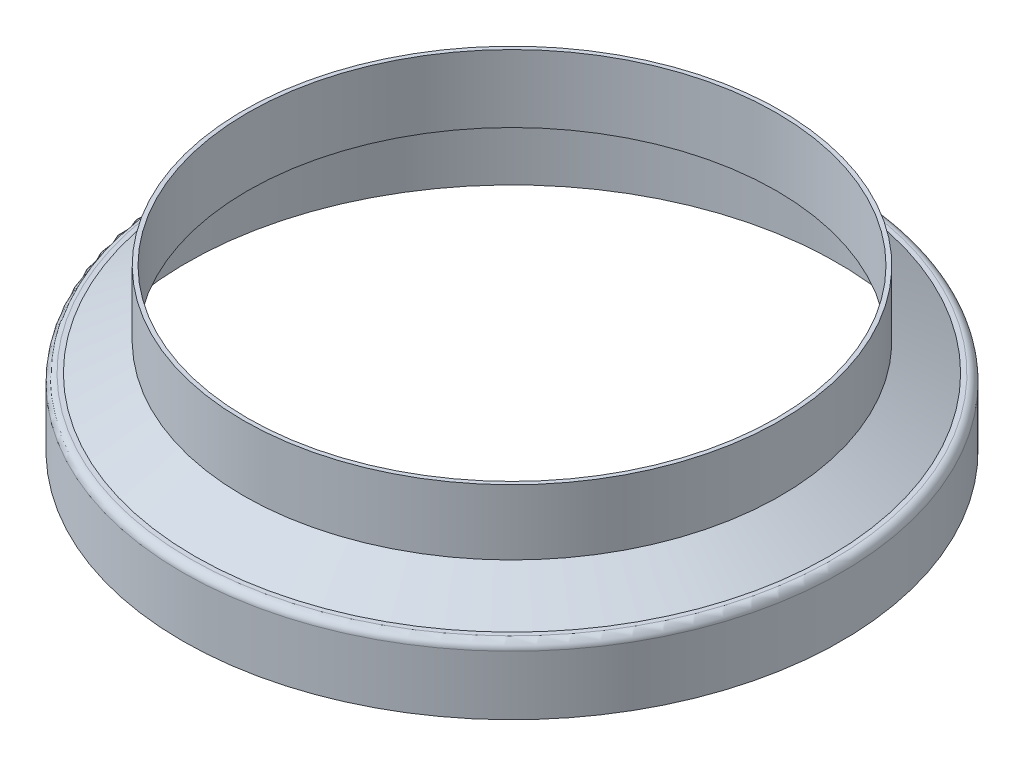
ISO-10303-21;
HEADER;
FILE_DESCRIPTION(('STEP AP214'),'2;1');
FILE_NAME('part.step','',(''),(''),'','','');
FILE_SCHEMA(('AUTOMOTIVE_DESIGN { 1 0 10303 214 1 1 1 1 }'));
ENDSEC;
DATA;
#1=APPLICATION_CONTEXT('core data for automotive mechanical design processes');
#2=APPLICATION_PROTOCOL_DEFINITION('international standard','automotive_design',2000,#1);
#3=PRODUCT_CONTEXT('',#1,'mechanical');
#4=PRODUCT('Part','Part','',(#3));
#5=PRODUCT_RELATED_PRODUCT_CATEGORY('part','',(#4));
#6=PRODUCT_DEFINITION_FORMATION('','',#4);
#7=PRODUCT_DEFINITION_CONTEXT('part definition',#1,'design');
#8=PRODUCT_DEFINITION('design','',#6,#7);
#9=PRODUCT_DEFINITION_SHAPE('','',#8);
#10=(LENGTH_UNIT() NAMED_UNIT(*) SI_UNIT(.MILLI.,.METRE.));
#11=(NAMED_UNIT(*) PLANE_ANGLE_UNIT() SI_UNIT($,.RADIAN.));
#12=(NAMED_UNIT(*) SI_UNIT($,.STERADIAN.) SOLID_ANGLE_UNIT());
#13=UNCERTAINTY_MEASURE_WITH_UNIT(LENGTH_MEASURE(1.E-05),#10,'distance_accuracy_value','');
#14=(GEOMETRIC_REPRESENTATION_CONTEXT(3) GLOBAL_UNCERTAINTY_ASSIGNED_CONTEXT((#13)) GLOBAL_UNIT_ASSIGNED_CONTEXT((#10,
#11,#12)) REPRESENTATION_CONTEXT('',''));
#15=CARTESIAN_POINT('',(0.,0.,0.));
#16=DIRECTION('',(0.,0.,1.));
#17=DIRECTION('',(1.,0.,0.));
#18=AXIS2_PLACEMENT_3D('',#15,#16,#17);
#19=CARTESIAN_POINT('',(21.9074999999999,8.10259999999993,0.));
#20=DIRECTION('',(0.,-1.,0.));
#21=DIRECTION('',(0.,0.,-1.));
#22=AXIS2_PLACEMENT_3D('',#19,#20,#21);
#23=PLANE('',#22);
#24=CARTESIAN_POINT('',(0.,8.10259999999988,1.11022302462516E-13));
#25=DIRECTION('',(0.,1.,0.));
#26=DIRECTION('',(0.,0.,1.));
#27=AXIS2_PLACEMENT_3D('',#24,#25,#26);
#28=CIRCLE('',#27,21.5265);
#29=CARTESIAN_POINT('',(0.,8.10259999999987,21.5265000000001));
#30=VERTEX_POINT('',#29);
#31=EDGE_CURVE('E10',#30,#30,#28,.T.);
#32=ORIENTED_EDGE('',*,*,#31,.T.);
#33=EDGE_LOOP('',(#32));
#34=FACE_BOUND('',#33,.T.);
#35=CARTESIAN_POINT('',(0.,8.10259999999988,1.11022302462516E-13));
#36=DIRECTION('',(0.,1.,0.));
#37=DIRECTION('',(0.,0.,1.));
#38=AXIS2_PLACEMENT_3D('',#35,#36,#37);
#39=CIRCLE('',#38,21.9075);
#40=CARTESIAN_POINT('',(0.,8.10259999999987,21.9075000000001));
#41=VERTEX_POINT('',#40);
#42=EDGE_CURVE('E66',#41,#41,#39,.T.);
#43=ORIENTED_EDGE('',*,*,#42,.F.);
#44=EDGE_LOOP('',(#43));
#45=FACE_BOUND('',#44,.T.);
#46=ADVANCED_FACE('F26',(#34,#45),#23,.T.);
#47=CARTESIAN_POINT('',(0.,8.10259999999988,1.11022302462516E-13));
#48=DIRECTION('',(0.,-1.,0.));
#49=DIRECTION('',(0.,0.,-1.));
#50=AXIS2_PLACEMENT_3D('',#47,#48,#49);
#51=CONICAL_SURFACE('',#50,21.5265,1.04719755119659);
#52=CARTESIAN_POINT('',(0.,10.1336605119821,0.));
#53=DIRECTION('',(0.,1.,0.));
#54=DIRECTION('',(0.,0.,1.));
#55=AXIS2_PLACEMENT_3D('',#52,#53,#54);
#56=CIRCLE('',#55,18.0086);
#57=CARTESIAN_POINT('',(0.,10.1336605119821,18.0086));
#58=VERTEX_POINT('',#57);
#59=EDGE_CURVE('E32',#58,#58,#56,.T.);
#60=ORIENTED_EDGE('',*,*,#59,.T.);
#61=EDGE_LOOP('',(#60));
#62=FACE_BOUND('',#61,.T.);
#63=ORIENTED_EDGE('',*,*,#31,.F.);
#64=EDGE_LOOP('',(#63));
#65=FACE_BOUND('',#64,.T.);
#66=ADVANCED_FACE('F74',(#62,#65),#51,.F.);
#67=CARTESIAN_POINT('',(0.,3.81000000000001,0.));
#68=DIRECTION('',(0.,1.,0.));
#69=DIRECTION('',(0.,0.,1.));
#70=AXIS2_PLACEMENT_3D('',#67,#68,#69);
#71=CYLINDRICAL_SURFACE('',#70,18.0086);
#72=CARTESIAN_POINT('',(0.,14.732,0.));
#73=DIRECTION('',(0.,1.,0.));
#74=DIRECTION('',(0.,0.,1.));
#75=AXIS2_PLACEMENT_3D('',#72,#73,#74);
#76=CIRCLE('',#75,18.0086);
#77=CARTESIAN_POINT('',(0.,14.732,18.0086));
#78=VERTEX_POINT('',#77);
#79=EDGE_CURVE('E36',#78,#78,#76,.T.);
#80=ORIENTED_EDGE('',*,*,#79,.T.);
#81=EDGE_LOOP('',(#80));
#82=FACE_BOUND('',#81,.T.);
#83=ORIENTED_EDGE('',*,*,#59,.F.);
#84=EDGE_LOOP('',(#83));
#85=FACE_BOUND('',#84,.T.);
#86=ADVANCED_FACE('F78',(#82,#85),#71,.F.);
#87=CARTESIAN_POINT('',(18.0086,14.732,1.11022302462516E-13));
#88=DIRECTION('',(0.,1.,0.));
#89=DIRECTION('',(0.,0.,1.));
#90=AXIS2_PLACEMENT_3D('',#87,#88,#89);
#91=PLANE('',#90);
#92=CARTESIAN_POINT('',(0.,14.732,0.));
#93=DIRECTION('',(0.,1.,0.));
#94=DIRECTION('',(0.,0.,1.));
#95=AXIS2_PLACEMENT_3D('',#92,#93,#94);
#96=CIRCLE('',#95,18.288);
#97=CARTESIAN_POINT('',(0.,14.732,18.288));
#98=VERTEX_POINT('',#97);
#99=EDGE_CURVE('E40',#98,#98,#96,.T.);
#100=ORIENTED_EDGE('',*,*,#99,.T.);
#101=EDGE_LOOP('',(#100));
#102=FACE_BOUND('',#101,.T.);
#103=ORIENTED_EDGE('',*,*,#79,.F.);
#104=EDGE_LOOP('',(#103));
#105=FACE_BOUND('',#104,.T.);
#106=ADVANCED_FACE('F82',(#102,#105),#91,.T.);
#107=CARTESIAN_POINT('',(0.,3.81000000000001,0.));
#108=DIRECTION('',(0.,1.,0.));
#109=DIRECTION('',(0.,0.,1.));
#110=AXIS2_PLACEMENT_3D('',#107,#108,#109);
#111=CYLINDRICAL_SURFACE('',#110,18.288);
#112=CARTESIAN_POINT('',(0.,10.2949721771938,0.));
#113=DIRECTION('',(0.,1.,0.));
#114=DIRECTION('',(0.,0.,1.));
#115=AXIS2_PLACEMENT_3D('',#112,#113,#114);
#116=CIRCLE('',#115,18.288);
#117=CARTESIAN_POINT('',(0.,10.2949721771938,18.2879999999999));
#118=VERTEX_POINT('',#117);
#119=EDGE_CURVE('E45',#118,#118,#116,.T.);
#120=ORIENTED_EDGE('',*,*,#119,.T.);
#121=EDGE_LOOP('',(#120));
#122=FACE_BOUND('',#121,.T.);
#123=ORIENTED_EDGE('',*,*,#99,.F.);
#124=EDGE_LOOP('',(#123));
#125=FACE_BOUND('',#124,.T.);
#126=ADVANCED_FACE('F89',(#122,#125),#111,.T.);
#127=CARTESIAN_POINT('',(0.,10.2949721771938,0.));
#128=DIRECTION('',(0.,-1.,0.));
#129=DIRECTION('',(0.,0.,-1.));
#130=AXIS2_PLACEMENT_3D('',#127,#128,#129);
#131=CONICAL_SURFACE('',#130,18.288,1.04719755119659);
#132=CARTESIAN_POINT('',(0.,8.38199999999997,0.));
#133=DIRECTION('',(0.,1.,0.));
#134=DIRECTION('',(0.,0.,1.));
#135=AXIS2_PLACEMENT_3D('',#132,#133,#134);
#136=CIRCLE('',#135,21.6013650043652);
#137=CARTESIAN_POINT('',(0.,8.38199999999997,21.6013650043652));
#138=VERTEX_POINT('',#137);
#139=EDGE_CURVE('E48',#138,#138,#136,.T.);
#140=ORIENTED_EDGE('',*,*,#139,.T.);
#141=EDGE_LOOP('',(#140));
#142=FACE_BOUND('',#141,.T.);
#143=ORIENTED_EDGE('',*,*,#119,.F.);
#144=EDGE_LOOP('',(#143));
#145=FACE_BOUND('',#144,.T.);
#146=ADVANCED_FACE('F93',(#142,#145),#131,.T.);
#147=CARTESIAN_POINT('',(21.6013650043652,8.38199999999997,0.));
#148=DIRECTION('',(0.,1.,0.));
#149=DIRECTION('',(0.,0.,1.));
#150=AXIS2_PLACEMENT_3D('',#147,#148,#149);
#151=PLANE('',#150);
#152=CARTESIAN_POINT('',(0.,8.38199999999997,0.));
#153=DIRECTION('',(0.,1.,0.));
#154=DIRECTION('',(0.,0.,1.));
#155=AXIS2_PLACEMENT_3D('',#152,#153,#154);
#156=CIRCLE('',#155,21.9075);
#157=CARTESIAN_POINT('',(0.,8.38199999999997,21.9075));
#158=VERTEX_POINT('',#157);
#159=EDGE_CURVE('E51',#158,#158,#156,.T.);
#160=ORIENTED_EDGE('',*,*,#159,.T.);
#161=EDGE_LOOP('',(#160));
#162=FACE_BOUND('',#161,.T.);
#163=ORIENTED_EDGE('',*,*,#139,.F.);
#164=EDGE_LOOP('',(#163));
#165=FACE_BOUND('',#164,.T.);
#166=ADVANCED_FACE('F97',(#162,#165),#151,.T.);
#167=CARTESIAN_POINT('',(0.,7.84860000000001,0.));
#168=DIRECTION('',(0.,1.,0.));
#169=DIRECTION('',(0.,0.,1.));
#170=AXIS2_PLACEMENT_3D('',#167,#168,#169);
#171=TOROIDAL_SURFACE('',#170,21.9075,0.533399999999998);
#172=CARTESIAN_POINT('',(0.,7.84860000000001,0.));
#173=DIRECTION('',(0.,1.,0.));
#174=DIRECTION('',(0.,0.,1.));
#175=AXIS2_PLACEMENT_3D('',#172,#173,#174);
#176=CIRCLE('',#175,22.4409);
#177=CARTESIAN_POINT('',(0.,7.84860000000001,22.4409));
#178=VERTEX_POINT('',#177);
#179=EDGE_CURVE('E54',#178,#178,#176,.T.);
#180=ORIENTED_EDGE('',*,*,#179,.T.);
#181=EDGE_LOOP('',(#180));
#182=FACE_BOUND('',#181,.T.);
#183=ORIENTED_EDGE('',*,*,#159,.F.);
#184=EDGE_LOOP('',(#183));
#185=FACE_BOUND('',#184,.T.);
#186=ADVANCED_FACE('F101',(#182,#185),#171,.T.);
#187=CARTESIAN_POINT('',(0.,3.81000000000001,0.));
#188=DIRECTION('',(0.,1.,0.));
#189=DIRECTION('',(0.,0.,1.));
#190=AXIS2_PLACEMENT_3D('',#187,#188,#189);
#191=CYLINDRICAL_SURFACE('',#190,22.4409);
#192=CARTESIAN_POINT('',(0.,3.81000000000001,0.));
#193=DIRECTION('',(0.,1.,0.));
#194=DIRECTION('',(0.,0.,1.));
#195=AXIS2_PLACEMENT_3D('',#192,#193,#194);
#196=CIRCLE('',#195,22.4409);
#197=CARTESIAN_POINT('',(0.,3.81,22.4408999999999));
#198=VERTEX_POINT('',#197);
#199=EDGE_CURVE('E57',#198,#198,#196,.T.);
#200=ORIENTED_EDGE('',*,*,#199,.T.);
#201=EDGE_LOOP('',(#200));
#202=FACE_BOUND('',#201,.T.);
#203=ORIENTED_EDGE('',*,*,#179,.F.);
#204=EDGE_LOOP('',(#203));
#205=FACE_BOUND('',#204,.T.);
#206=ADVANCED_FACE('F105',(#202,#205),#191,.T.);
#207=CARTESIAN_POINT('',(22.4408999999999,3.80999999999998,0.));
#208=DIRECTION('',(0.,-1.,0.));
#209=DIRECTION('',(0.,0.,-1.));
#210=AXIS2_PLACEMENT_3D('',#207,#208,#209);
#211=PLANE('',#210);
#212=CARTESIAN_POINT('',(0.,3.81000000000001,0.));
#213=DIRECTION('',(0.,1.,0.));
#214=DIRECTION('',(0.,0.,1.));
#215=AXIS2_PLACEMENT_3D('',#212,#213,#214);
#216=CIRCLE('',#215,22.1615);
#217=CARTESIAN_POINT('',(0.,3.81,22.1614999999999));
#218=VERTEX_POINT('',#217);
#219=EDGE_CURVE('E60',#218,#218,#216,.T.);
#220=ORIENTED_EDGE('',*,*,#219,.T.);
#221=EDGE_LOOP('',(#220));
#222=FACE_BOUND('',#221,.T.);
#223=ORIENTED_EDGE('',*,*,#199,.F.);
#224=EDGE_LOOP('',(#223));
#225=FACE_BOUND('',#224,.T.);
#226=ADVANCED_FACE('F109',(#222,#225),#211,.T.);
#227=CARTESIAN_POINT('',(0.,3.81000000000001,0.));
#228=DIRECTION('',(0.,1.,0.));
#229=DIRECTION('',(0.,0.,1.));
#230=AXIS2_PLACEMENT_3D('',#227,#228,#229);
#231=CYLINDRICAL_SURFACE('',#230,22.1615);
#232=CARTESIAN_POINT('',(0.,7.84860000000001,0.));
#233=DIRECTION('',(0.,1.,0.));
#234=DIRECTION('',(0.,0.,1.));
#235=AXIS2_PLACEMENT_3D('',#232,#233,#234);
#236=CIRCLE('',#235,22.1615);
#237=CARTESIAN_POINT('',(0.,7.84860000000001,22.1615));
#238=VERTEX_POINT('',#237);
#239=EDGE_CURVE('E63',#238,#238,#236,.T.);
#240=ORIENTED_EDGE('',*,*,#239,.T.);
#241=EDGE_LOOP('',(#240));
#242=FACE_BOUND('',#241,.T.);
#243=ORIENTED_EDGE('',*,*,#219,.F.);
#244=EDGE_LOOP('',(#243));
#245=FACE_BOUND('',#244,.T.);
#246=ADVANCED_FACE('F113',(#242,#245),#231,.F.);
#247=CARTESIAN_POINT('',(0.,7.84860000000001,0.));
#248=DIRECTION('',(0.,1.,0.));
#249=DIRECTION('',(0.,0.,1.));
#250=AXIS2_PLACEMENT_3D('',#247,#248,#249);
#251=TOROIDAL_SURFACE('',#250,21.9075,0.253999999999994);
#252=ORIENTED_EDGE('',*,*,#42,.T.);
#253=EDGE_LOOP('',(#252));
#254=FACE_BOUND('',#253,.T.);
#255=ORIENTED_EDGE('',*,*,#239,.F.);
#256=EDGE_LOOP('',(#255));
#257=FACE_BOUND('',#256,.T.);
#258=ADVANCED_FACE('F70',(#254,#257),#251,.F.);
#259=CLOSED_SHELL('',(#46,#66,#86,#106,#126,#146,#166,#186,#206,#226,#246,#258));
#260=MANIFOLD_SOLID_BREP('B2',#259);
#261=ADVANCED_BREP_SHAPE_REPRESENTATION('',(#18,#260),#14);
#262=SHAPE_DEFINITION_REPRESENTATION(#9,#261);
ENDSEC;
END-ISO-10303-21;
